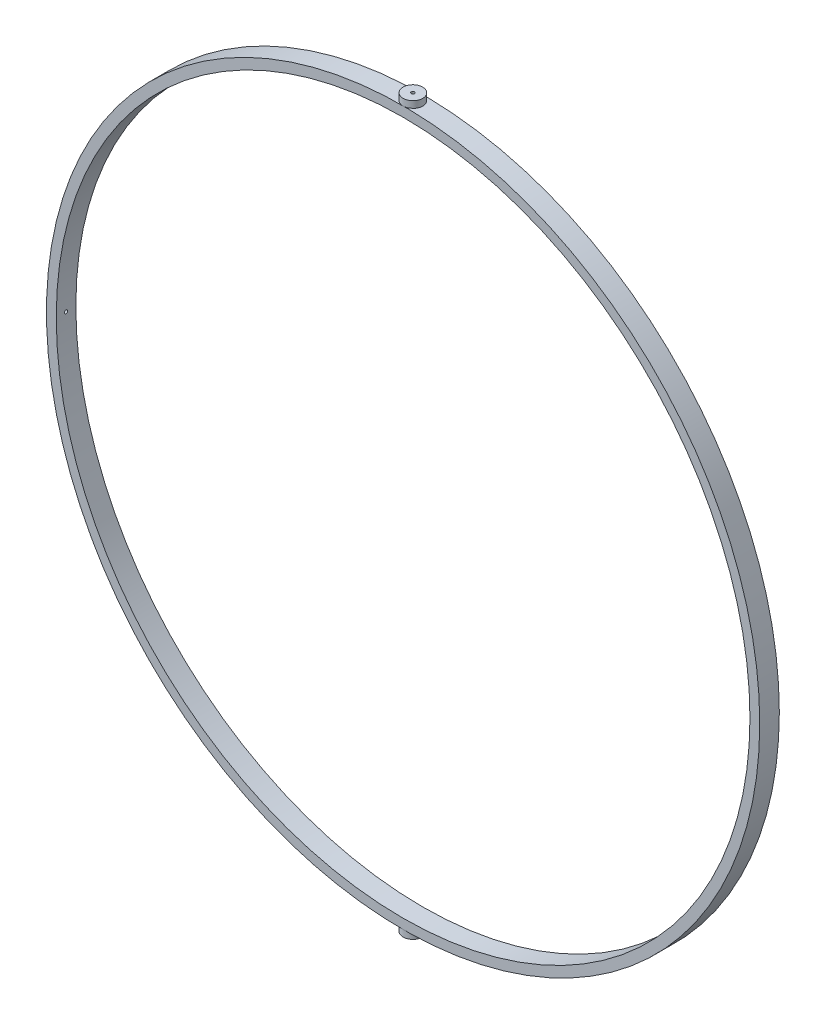
ISO-10303-21;
HEADER;
FILE_DESCRIPTION(('STEP AP214'),'2;1');
FILE_NAME('part.step','',(''),(''),'','','');
FILE_SCHEMA(('AUTOMOTIVE_DESIGN { 1 0 10303 214 1 1 1 1 }'));
ENDSEC;
DATA;
#1=APPLICATION_CONTEXT('core data for automotive mechanical design processes');
#2=APPLICATION_PROTOCOL_DEFINITION('international standard','automotive_design',2000,#1);
#3=PRODUCT_CONTEXT('',#1,'mechanical');
#4=PRODUCT('Part','Part','',(#3));
#5=PRODUCT_RELATED_PRODUCT_CATEGORY('part','',(#4));
#6=PRODUCT_DEFINITION_FORMATION('','',#4);
#7=PRODUCT_DEFINITION_CONTEXT('part definition',#1,'design');
#8=PRODUCT_DEFINITION('design','',#6,#7);
#9=PRODUCT_DEFINITION_SHAPE('','',#8);
#10=(LENGTH_UNIT() NAMED_UNIT(*) SI_UNIT(.MILLI.,.METRE.));
#11=(NAMED_UNIT(*) PLANE_ANGLE_UNIT() SI_UNIT($,.RADIAN.));
#12=(NAMED_UNIT(*) SI_UNIT($,.STERADIAN.) SOLID_ANGLE_UNIT());
#13=UNCERTAINTY_MEASURE_WITH_UNIT(LENGTH_MEASURE(1.E-05),#10,'distance_accuracy_value','');
#14=(GEOMETRIC_REPRESENTATION_CONTEXT(3) GLOBAL_UNCERTAINTY_ASSIGNED_CONTEXT((#13)) GLOBAL_UNIT_ASSIGNED_CONTEXT((#10,
#11,#12)) REPRESENTATION_CONTEXT('',''));
#15=CARTESIAN_POINT('',(0.,0.,0.));
#16=DIRECTION('',(0.,0.,1.));
#17=DIRECTION('',(1.,0.,0.));
#18=AXIS2_PLACEMENT_3D('',#15,#16,#17);
#19=CARTESIAN_POINT('',(0.,111.24716621,3.));
#20=DIRECTION('',(0.,1.,0.));
#21=DIRECTION('',(0.,0.,1.));
#22=AXIS2_PLACEMENT_3D('',#19,#20,#21);
#23=PLANE('',#22);
#24=CARTESIAN_POINT('',(0.,111.24716621,3.));
#25=DIRECTION('',(0.,1.,0.));
#26=DIRECTION('',(0.,0.,1.));
#27=AXIS2_PLACEMENT_3D('',#24,#25,#26);
#28=CIRCLE('',#27,3.);
#29=CARTESIAN_POINT('',(0.,111.24716621,6.));
#30=VERTEX_POINT('',#29);
#31=EDGE_CURVE('E11',#30,#30,#28,.T.);
#32=ORIENTED_EDGE('',*,*,#31,.T.);
#33=EDGE_LOOP('',(#32));
#34=FACE_BOUND('',#33,.T.);
#35=CARTESIAN_POINT('',(0.,111.24716621,3.));
#36=DIRECTION('',(0.,1.,0.));
#37=DIRECTION('',(0.,0.,1.));
#38=AXIS2_PLACEMENT_3D('',#35,#36,#37);
#39=CIRCLE('',#38,0.5);
#40=CARTESIAN_POINT('',(0.,111.24716621,3.5));
#41=VERTEX_POINT('',#40);
#42=EDGE_CURVE('E54',#41,#41,#39,.T.);
#43=ORIENTED_EDGE('',*,*,#42,.F.);
#44=EDGE_LOOP('',(#43));
#45=FACE_BOUND('',#44,.T.);
#46=ADVANCED_FACE('F43',(#34,#45),#23,.T.);
#47=CARTESIAN_POINT('',(0.,106.24716621,3.));
#48=DIRECTION('',(0.,1.,0.));
#49=DIRECTION('',(0.,0.,1.));
#50=AXIS2_PLACEMENT_3D('',#47,#48,#49);
#51=PLANE('',#50);
#52=CARTESIAN_POINT('',(0.,106.24716621,3.));
#53=DIRECTION('',(0.,1.,0.));
#54=DIRECTION('',(0.,0.,1.));
#55=AXIS2_PLACEMENT_3D('',#52,#53,#54);
#56=CIRCLE('',#55,3.);
#57=CARTESIAN_POINT('',(0.,106.24716621,6.));
#58=VERTEX_POINT('',#57);
#59=EDGE_CURVE('E47',#58,#58,#56,.T.);
#60=ORIENTED_EDGE('',*,*,#59,.F.);
#61=EDGE_LOOP('',(#60));
#62=FACE_BOUND('',#61,.T.);
#63=CARTESIAN_POINT('',(0.,106.24716621,3.));
#64=DIRECTION('',(0.,1.,0.));
#65=DIRECTION('',(0.,0.,1.));
#66=AXIS2_PLACEMENT_3D('',#63,#64,#65);
#67=CIRCLE('',#66,0.5);
#68=CARTESIAN_POINT('',(0.,106.24716621,3.5));
#69=VERTEX_POINT('',#68);
#70=EDGE_CURVE('E56',#69,#69,#67,.T.);
#71=ORIENTED_EDGE('',*,*,#70,.T.);
#72=EDGE_LOOP('',(#71));
#73=FACE_BOUND('',#72,.T.);
#74=ADVANCED_FACE('F66',(#62,#73),#51,.F.);
#75=CARTESIAN_POINT('',(0.,111.24716621,3.));
#76=DIRECTION('',(0.,-1.,0.));
#77=DIRECTION('',(0.,0.,-1.));
#78=AXIS2_PLACEMENT_3D('',#75,#76,#77);
#79=CYLINDRICAL_SURFACE('',#78,3.);
#80=ORIENTED_EDGE('',*,*,#31,.F.);
#81=EDGE_LOOP('',(#80));
#82=FACE_BOUND('',#81,.T.);
#83=ORIENTED_EDGE('',*,*,#59,.T.);
#84=EDGE_LOOP('',(#83));
#85=FACE_BOUND('',#84,.T.);
#86=ADVANCED_FACE('F45',(#82,#85),#79,.T.);
#87=CARTESIAN_POINT('',(0.,111.24716621,3.));
#88=DIRECTION('',(0.,-1.,0.));
#89=DIRECTION('',(0.,0.,-1.));
#90=AXIS2_PLACEMENT_3D('',#87,#88,#89);
#91=CYLINDRICAL_SURFACE('',#90,0.5);
#92=ORIENTED_EDGE('',*,*,#42,.T.);
#93=EDGE_LOOP('',(#92));
#94=FACE_BOUND('',#93,.T.);
#95=ORIENTED_EDGE('',*,*,#70,.F.);
#96=EDGE_LOOP('',(#95));
#97=FACE_BOUND('',#96,.T.);
#98=ADVANCED_FACE('F62',(#94,#97),#91,.F.);
#99=CLOSED_SHELL('',(#46,#74,#86,#98));
#100=MANIFOLD_SOLID_BREP('B2',#99);
#101=CARTESIAN_POINT('',(0.,-111.24716621,3.00000000000001));
#102=DIRECTION('',(0.,1.,0.));
#103=DIRECTION('',(0.,0.,1.));
#104=AXIS2_PLACEMENT_3D('',#101,#102,#103);
#105=CYLINDRICAL_SURFACE('',#104,3.);
#106=CARTESIAN_POINT('',(0.,-111.24716621,3.00000000000001));
#107=DIRECTION('',(0.,1.,0.));
#108=DIRECTION('',(0.,0.,1.));
#109=AXIS2_PLACEMENT_3D('',#106,#107,#108);
#110=CIRCLE('',#109,3.);
#111=CARTESIAN_POINT('',(0.,-111.24716621,6.00000000000001));
#112=VERTEX_POINT('',#111);
#113=EDGE_CURVE('E42',#112,#112,#110,.T.);
#114=ORIENTED_EDGE('',*,*,#113,.T.);
#115=EDGE_LOOP('',(#114));
#116=FACE_BOUND('',#115,.T.);
#117=CARTESIAN_POINT('',(0.,-106.24716621,3.00000000000001));
#118=DIRECTION('',(0.,1.,0.));
#119=DIRECTION('',(0.,0.,1.));
#120=AXIS2_PLACEMENT_3D('',#117,#118,#119);
#121=CIRCLE('',#120,3.);
#122=CARTESIAN_POINT('',(0.,-106.24716621,6.00000000000001));
#123=VERTEX_POINT('',#122);
#124=EDGE_CURVE('E114',#123,#123,#121,.T.);
#125=ORIENTED_EDGE('',*,*,#124,.F.);
#126=EDGE_LOOP('',(#125));
#127=FACE_BOUND('',#126,.T.);
#128=ADVANCED_FACE('F111',(#116,#127),#105,.T.);
#129=CARTESIAN_POINT('',(0.,-111.24716621,3.00000000000001));
#130=DIRECTION('',(0.,1.,0.));
#131=DIRECTION('',(0.,0.,1.));
#132=AXIS2_PLACEMENT_3D('',#129,#130,#131);
#133=PLANE('',#132);
#134=CARTESIAN_POINT('',(0.,-111.24716621,3.00000000000001));
#135=DIRECTION('',(0.,1.,0.));
#136=DIRECTION('',(0.,0.,1.));
#137=AXIS2_PLACEMENT_3D('',#134,#135,#136);
#138=CIRCLE('',#137,0.5);
#139=CARTESIAN_POINT('',(0.,-111.24716621,3.50000000000001));
#140=VERTEX_POINT('',#139);
#141=EDGE_CURVE('E121',#140,#140,#138,.T.);
#142=ORIENTED_EDGE('',*,*,#141,.T.);
#143=EDGE_LOOP('',(#142));
#144=FACE_BOUND('',#143,.T.);
#145=ORIENTED_EDGE('',*,*,#113,.F.);
#146=EDGE_LOOP('',(#145));
#147=FACE_BOUND('',#146,.T.);
#148=ADVANCED_FACE('F129',(#144,#147),#133,.F.);
#149=CARTESIAN_POINT('',(0.,-106.24716621,3.00000000000001));
#150=DIRECTION('',(0.,1.,0.));
#151=DIRECTION('',(0.,0.,1.));
#152=AXIS2_PLACEMENT_3D('',#149,#150,#151);
#153=PLANE('',#152);
#154=CARTESIAN_POINT('',(0.,-106.24716621,3.00000000000001));
#155=DIRECTION('',(0.,1.,0.));
#156=DIRECTION('',(0.,0.,1.));
#157=AXIS2_PLACEMENT_3D('',#154,#155,#156);
#158=CIRCLE('',#157,0.5);
#159=CARTESIAN_POINT('',(0.,-106.24716621,3.50000000000001));
#160=VERTEX_POINT('',#159);
#161=EDGE_CURVE('E123',#160,#160,#158,.T.);
#162=ORIENTED_EDGE('',*,*,#161,.F.);
#163=EDGE_LOOP('',(#162));
#164=FACE_BOUND('',#163,.T.);
#165=ORIENTED_EDGE('',*,*,#124,.T.);
#166=EDGE_LOOP('',(#165));
#167=FACE_BOUND('',#166,.T.);
#168=ADVANCED_FACE('F135',(#164,#167),#153,.T.);
#169=CARTESIAN_POINT('',(0.,-111.24716621,3.00000000000001));
#170=DIRECTION('',(0.,1.,0.));
#171=DIRECTION('',(0.,0.,1.));
#172=AXIS2_PLACEMENT_3D('',#169,#170,#171);
#173=CYLINDRICAL_SURFACE('',#172,0.5);
#174=ORIENTED_EDGE('',*,*,#141,.F.);
#175=EDGE_LOOP('',(#174));
#176=FACE_BOUND('',#175,.T.);
#177=ORIENTED_EDGE('',*,*,#161,.T.);
#178=EDGE_LOOP('',(#177));
#179=FACE_BOUND('',#178,.T.);
#180=ADVANCED_FACE('F132',(#176,#179),#173,.F.);
#181=CLOSED_SHELL('',(#128,#148,#168,#180));
#182=MANIFOLD_SOLID_BREP('B6',#181);
#183=CARTESIAN_POINT('',(0.,0.,6.));
#184=DIRECTION('',(0.,0.,-1.));
#185=DIRECTION('',(-1.,0.,0.));
#186=AXIS2_PLACEMENT_3D('',#183,#184,#185);
#187=CYLINDRICAL_SURFACE('',#186,106.24716621);
#188=CARTESIAN_POINT('',(-106.24716621,0.,3.5));
#189=CARTESIAN_POINT('',(-106.24716619409,-0.0280850526568237,3.49999875463392));
#190=CARTESIAN_POINT('',(-106.247154954555,-0.0561904656604527,3.49762574936218));
#191=CARTESIAN_POINT('',(-106.247111198308,-0.111627242477362,3.48819229674412));
#192=CARTESIAN_POINT('',(-106.247078655992,-0.138957633456587,3.48112620839675));
#193=CARTESIAN_POINT('',(-106.246995980659,-0.192033204923472,3.46250775953338));
#194=CARTESIAN_POINT('',(-106.246945856049,-0.21777913622338,3.45095754312816));
#195=CARTESIAN_POINT('',(-106.246833674865,-0.266959234393877,3.42370165452289));
#196=CARTESIAN_POINT('',(-106.246771621257,-0.29039397386278,3.40799701515049));
#197=CARTESIAN_POINT('',(-106.246642562286,-0.334297344162967,3.372874777901));
#198=CARTESIAN_POINT('',(-106.246575556371,-0.354765643806542,3.35345676600548));
#199=CARTESIAN_POINT('',(-106.246444149999,-0.392152484654138,3.31145925078089));
#200=CARTESIAN_POINT('',(-106.246379749645,-0.409070886406095,3.28887962331087));
#201=CARTESIAN_POINT('',(-106.246260819028,-0.438876502583367,3.24120077201254));
#202=CARTESIAN_POINT('',(-106.246206288627,-0.451763773398321,3.21610158343571));
#203=CARTESIAN_POINT('',(-106.246113244895,-0.473141565467952,3.16409588385815));
#204=CARTESIAN_POINT('',(-106.246074731531,-0.481632095779887,3.13718937658063));
#205=CARTESIAN_POINT('',(-106.246018064117,-0.493975380155324,3.08233295235052));
#206=CARTESIAN_POINT('',(-106.245999909952,-0.497828160209652,3.05438304124628));
#207=CARTESIAN_POINT('',(-106.245986007366,-0.500786648823005,2.99823314619326));
#208=CARTESIAN_POINT('',(-106.245990258903,-0.499892366191744,2.97003316270867));
#209=CARTESIAN_POINT('',(-106.246020688169,-0.493382163260322,2.9141838111527));
#210=CARTESIAN_POINT('',(-106.246046865731,-0.48776627861956,2.88653443892449));
#211=CARTESIAN_POINT('',(-106.246118195506,-0.471972337070134,2.83257093749928));
#212=CARTESIAN_POINT('',(-106.246163347739,-0.461794275216539,2.80625680974957));
#213=CARTESIAN_POINT('',(-106.246267536485,-0.437164864263754,2.75571069654151));
#214=CARTESIAN_POINT('',(-106.246326573049,-0.422713499335047,2.73147871879646));
#215=CARTESIAN_POINT('',(-106.246451874467,-0.389947732001803,2.68578487159618));
#216=CARTESIAN_POINT('',(-106.246518139319,-0.371633330905123,2.66432300120312));
#217=CARTESIAN_POINT('',(-106.246650427281,-0.331661164895708,2.62477837580178));
#218=CARTESIAN_POINT('',(-106.246716450389,-0.310003367113331,2.60669565401851));
#219=CARTESIAN_POINT('',(-106.246840810657,-0.263959321890282,2.57442289446867));
#220=CARTESIAN_POINT('',(-106.246899147815,-0.239573074091296,2.56023285721332));
#221=CARTESIAN_POINT('',(-106.24700155914,-0.188764367965494,2.53614828744321));
#222=CARTESIAN_POINT('',(-106.247045633304,-0.162341909264108,2.52625375571864));
#223=CARTESIAN_POINT('',(-106.247114549579,-0.108210845149136,2.51104109363585));
#224=CARTESIAN_POINT('',(-106.247139391691,-0.0805022398781877,2.50572296277009));
#225=CARTESIAN_POINT('',(-106.247167042952,-0.0245857318079601,2.49981410770113));
#226=CARTESIAN_POINT('',(-106.247169852312,0.00362216619796849,2.49922333813856));
#227=CARTESIAN_POINT('',(-106.247153121895,0.0597367723237679,2.50278585784098));
#228=CARTESIAN_POINT('',(-106.247133582117,0.0876434804389804,2.50693914717934));
#229=CARTESIAN_POINT('',(-106.2470743565,0.142363391624133,2.51987184815417));
#230=CARTESIAN_POINT('',(-106.247034670749,0.169176599501214,2.52865123945146));
#231=CARTESIAN_POINT('',(-106.246939627402,0.220948506650455,2.5505869012439));
#232=CARTESIAN_POINT('',(-106.246884269806,0.245907206066894,2.56374317139853));
#233=CARTESIAN_POINT('',(-106.246764123273,0.293261802416632,2.59405923878603));
#234=CARTESIAN_POINT('',(-106.246699334265,0.315657680104834,2.61121906608004));
#235=CARTESIAN_POINT('',(-106.246567629513,0.357250696024964,2.64905509461572));
#236=CARTESIAN_POINT('',(-106.246500713768,0.376447832793392,2.66973129746622));
#237=CARTESIAN_POINT('',(-106.24637229918,0.411098562319901,2.71401333700411));
#238=CARTESIAN_POINT('',(-106.246310800381,0.426552124672,2.73761919748435));
#239=CARTESIAN_POINT('',(-106.24620015396,0.453276802600816,2.78709030320605));
#240=CARTESIAN_POINT('',(-106.246151006325,0.464547922716439,2.81295554599553));
#241=CARTESIAN_POINT('',(-106.246070603492,0.482587730610547,2.86621107949851));
#242=CARTESIAN_POINT('',(-106.246039348213,0.48935643908239,2.89360136320221));
#243=CARTESIAN_POINT('',(-106.245998253605,0.498199356896419,2.94912960033905));
#244=CARTESIAN_POINT('',(-106.245988414314,0.500273558088429,2.97726755507015));
#245=CARTESIAN_POINT('',(-106.24599126113,0.49966855635258,3.03349198801219));
#246=CARTESIAN_POINT('',(-106.246003946978,0.496989408356531,3.06157846681427));
#247=CARTESIAN_POINT('',(-106.246050413344,0.486953858481562,3.11690303823312));
#248=CARTESIAN_POINT('',(-106.246084193904,0.479597447199967,3.14414112914427));
#249=CARTESIAN_POINT('',(-106.246169041993,0.460416038264928,3.19699615574931));
#250=CARTESIAN_POINT('',(-106.246220109842,0.448590957467226,3.222613061269));
#251=CARTESIAN_POINT('',(-106.246333772389,0.420808392737228,3.27149701742432));
#252=CARTESIAN_POINT('',(-106.246396366634,0.404851070749366,3.29476416009858));
#253=CARTESIAN_POINT('',(-106.246526020563,0.369258721402353,3.33828720408426));
#254=CARTESIAN_POINT('',(-106.246593079823,0.349624043445579,3.3585433911526));
#255=CARTESIAN_POINT('',(-106.246724126631,0.307226943123988,3.39547702065792));
#256=CARTESIAN_POINT('',(-106.246788113411,0.284463744645473,3.41215357243196));
#257=CARTESIAN_POINT('',(-106.246905811215,0.236451688313928,3.44145471726159));
#258=CARTESIAN_POINT('',(-106.246959517274,0.211201638444088,3.45407735469089));
#259=CARTESIAN_POINT('',(-106.247050493819,0.158960534008959,3.47488979719271));
#260=CARTESIAN_POINT('',(-106.247087783996,0.131971610021824,3.48308491573569));
#261=CARTESIAN_POINT('',(-106.247131704384,0.0873422678778225,3.49262581566448));
#262=CARTESIAN_POINT('',(-106.247144588239,0.0699918337712364,3.49538768292258));
#263=CARTESIAN_POINT('',(-106.247161846018,0.0350969173106342,3.4990751642447));
#264=CARTESIAN_POINT('',(-106.247166219943,0.0175524349579925,3.50000077832174));
#265=CARTESIAN_POINT('',(-106.24716621,0.,3.5));
#266=B_SPLINE_CURVE_WITH_KNOTS('',3,(#188,#189,#190,#191,#192,#193,#194,#195,#196,#197,#198,
#199,#200,#201,#202,#203,#204,#205,#206,#207,#208,#209,#210,#211,#212,#213,#214,#215,#216,#217,
#218,#219,#220,#221,#222,#223,#224,#225,#226,#227,#228,#229,#230,#231,#232,#233,#234,#235,#236,
#237,#238,#239,#240,#241,#242,#243,#244,#245,#246,#247,#248,#249,#250,#251,#252,#253,#254,#255,
#256,#257,#258,#259,#260,#261,#262,#263,#264,#265),.UNSPECIFIED.,.T.,.F.,(4,2,2,2,2,2,2,2,2,2,2,
2,2,2,2,2,2,2,2,2,2,2,2,2,2,2,2,2,2,2,2,2,2,2,2,2,2,2,4),(0.,0.0841910915724384,
0.168483562899297,0.252735778854399,0.336967068588698,0.421207755079796,0.505451750212303,
0.589694566841535,0.673937209930408,0.758179380905462,0.842421395541886,0.926662773955109,
1.01090424367754,1.09514602545798,1.17938777871784,1.26363036022896,1.34787295280326,
1.43211556087436,1.51635815960266,1.60059995001644,1.68484174173316,1.76908316307426,
1.8533245778614,1.93756662520435,2.02180871108992,2.10605148118187,2.19029415985086,
2.2745364513327,2.35877888906821,2.44302035326711,2.52726198681668,2.61150518784692,
2.6957450878469,2.77997698788628,2.86422982175989,2.94852323873759,3.03271526910187,
3.08533253449892,3.1379497995233),.UNSPECIFIED.);
#267=CARTESIAN_POINT('',(-106.24716621,0.,3.5));
#268=VERTEX_POINT('',#267);
#269=EDGE_CURVE('E176',#268,#268,#266,.T.);
#270=ORIENTED_EDGE('',*,*,#269,.F.);
#271=EDGE_LOOP('',(#270));
#272=FACE_BOUND('',#271,.T.);
#273=CARTESIAN_POINT('',(0.,0.,0.));
#274=DIRECTION('',(0.,0.,1.));
#275=DIRECTION('',(1.,0.,0.));
#276=AXIS2_PLACEMENT_3D('',#273,#274,#275);
#277=CIRCLE('',#276,106.24716621);
#278=CARTESIAN_POINT('',(106.24716621,0.,0.));
#279=VERTEX_POINT('',#278);
#280=EDGE_CURVE('E193',#279,#279,#277,.T.);
#281=ORIENTED_EDGE('',*,*,#280,.F.);
#282=EDGE_LOOP('',(#281));
#283=FACE_BOUND('',#282,.T.);
#284=CARTESIAN_POINT('',(0.,0.,6.));
#285=DIRECTION('',(0.,0.,1.));
#286=DIRECTION('',(1.,0.,0.));
#287=AXIS2_PLACEMENT_3D('',#284,#285,#286);
#288=CIRCLE('',#287,106.24716621);
#289=CARTESIAN_POINT('',(106.24716621,0.,6.));
#290=VERTEX_POINT('',#289);
#291=EDGE_CURVE('E190',#290,#290,#288,.T.);
#292=ORIENTED_EDGE('',*,*,#291,.T.);
#293=EDGE_LOOP('',(#292));
#294=FACE_BOUND('',#293,.T.);
#295=CARTESIAN_POINT('',(106.24716621,0.,2.5));
#296=CARTESIAN_POINT('',(106.24716619409,0.0280850526568237,2.50000124536608));
#297=CARTESIAN_POINT('',(106.247154954555,0.0561904656604527,2.50237425063782));
#298=CARTESIAN_POINT('',(106.247111198308,0.111627242477362,2.51180770325588));
#299=CARTESIAN_POINT('',(106.247078655992,0.138957633456587,2.51887379160325));
#300=CARTESIAN_POINT('',(106.246995980659,0.192033204923473,2.53749224046662));
#301=CARTESIAN_POINT('',(106.246945856049,0.21777913622338,2.54904245687184));
#302=CARTESIAN_POINT('',(106.246833674865,0.266959234393878,2.57629834547711));
#303=CARTESIAN_POINT('',(106.246771621257,0.29039397386278,2.59200298484951));
#304=CARTESIAN_POINT('',(106.246642562286,0.334297344162967,2.627125222099));
#305=CARTESIAN_POINT('',(106.246575556371,0.354765643806542,2.64654323399452));
#306=CARTESIAN_POINT('',(106.246444149999,0.392152484654138,2.68854074921911));
#307=CARTESIAN_POINT('',(106.246379749645,0.409070886406095,2.71112037668913));
#308=CARTESIAN_POINT('',(106.246260819028,0.438876502583367,2.75879922798746));
#309=CARTESIAN_POINT('',(106.246206288627,0.451763773398321,2.78389841656429));
#310=CARTESIAN_POINT('',(106.246113244895,0.473141565467952,2.83590411614185));
#311=CARTESIAN_POINT('',(106.246074731531,0.481632095779887,2.86281062341937));
#312=CARTESIAN_POINT('',(106.246018064117,0.493975380155324,2.91766704764948));
#313=CARTESIAN_POINT('',(106.245999909952,0.497828160209652,2.94561695875372));
#314=CARTESIAN_POINT('',(106.245986007366,0.500786648823005,3.00176685380674));
#315=CARTESIAN_POINT('',(106.245990258903,0.499892366191744,3.02996683729133));
#316=CARTESIAN_POINT('',(106.246020688169,0.493382163260322,3.0858161888473));
#317=CARTESIAN_POINT('',(106.246046865731,0.48776627861956,3.11346556107551));
#318=CARTESIAN_POINT('',(106.246118195506,0.471972337070134,3.16742906250072));
#319=CARTESIAN_POINT('',(106.246163347739,0.461794275216539,3.19374319025043));
#320=CARTESIAN_POINT('',(106.246267536485,0.437164864263754,3.24428930345849));
#321=CARTESIAN_POINT('',(106.246326573049,0.422713499335047,3.26852128120354));
#322=CARTESIAN_POINT('',(106.246451874467,0.389947732001803,3.31421512840382));
#323=CARTESIAN_POINT('',(106.246518139319,0.371633330905123,3.33567699879688));
#324=CARTESIAN_POINT('',(106.246650427281,0.331661164895708,3.37522162419822));
#325=CARTESIAN_POINT('',(106.246716450389,0.310003367113331,3.39330434598149));
#326=CARTESIAN_POINT('',(106.246840810657,0.263959321890282,3.42557710553133));
#327=CARTESIAN_POINT('',(106.246899147815,0.239573074091296,3.43976714278668));
#328=CARTESIAN_POINT('',(106.24700155914,0.188764367965494,3.46385171255679));
#329=CARTESIAN_POINT('',(106.247045633304,0.162341909264108,3.47374624428136));
#330=CARTESIAN_POINT('',(106.247114549579,0.108210845149136,3.48895890636415));
#331=CARTESIAN_POINT('',(106.247139391691,0.0805022398781877,3.49427703722991));
#332=CARTESIAN_POINT('',(106.247167042952,0.0245857318079601,3.50018589229887));
#333=CARTESIAN_POINT('',(106.247169852312,-0.00362216619796849,3.50077666186144));
#334=CARTESIAN_POINT('',(106.247153121895,-0.0597367723237679,3.49721414215902));
#335=CARTESIAN_POINT('',(106.247133582117,-0.0876434804389804,3.49306085282066));
#336=CARTESIAN_POINT('',(106.2470743565,-0.142363391624133,3.48012815184583));
#337=CARTESIAN_POINT('',(106.247034670749,-0.169176599501214,3.47134876054854));
#338=CARTESIAN_POINT('',(106.246939627402,-0.220948506650455,3.4494130987561));
#339=CARTESIAN_POINT('',(106.246884269806,-0.245907206066894,3.43625682860147));
#340=CARTESIAN_POINT('',(106.246764123273,-0.293261802416632,3.40594076121397));
#341=CARTESIAN_POINT('',(106.246699334265,-0.315657680104834,3.38878093391996));
#342=CARTESIAN_POINT('',(106.246567629513,-0.357250696024964,3.35094490538428));
#343=CARTESIAN_POINT('',(106.246500713768,-0.376447832793392,3.33026870253378));
#344=CARTESIAN_POINT('',(106.24637229918,-0.411098562319902,3.28598666299589));
#345=CARTESIAN_POINT('',(106.246310800381,-0.426552124672001,3.26238080251565));
#346=CARTESIAN_POINT('',(106.24620015396,-0.453276802600816,3.21290969679395));
#347=CARTESIAN_POINT('',(106.246151006325,-0.464547922716439,3.18704445400447));
#348=CARTESIAN_POINT('',(106.246070603492,-0.482587730610547,3.13378892050149));
#349=CARTESIAN_POINT('',(106.246039348213,-0.48935643908239,3.10639863679779));
#350=CARTESIAN_POINT('',(106.245998253605,-0.498199356896419,3.05087039966095));
#351=CARTESIAN_POINT('',(106.245988414314,-0.500273558088429,3.02273244492985));
#352=CARTESIAN_POINT('',(106.24599126113,-0.49966855635258,2.96650801198781));
#353=CARTESIAN_POINT('',(106.246003946978,-0.496989408356531,2.93842153318573));
#354=CARTESIAN_POINT('',(106.246050413344,-0.486953858481562,2.88309696176688));
#355=CARTESIAN_POINT('',(106.246084193904,-0.479597447199967,2.85585887085573));
#356=CARTESIAN_POINT('',(106.246169041993,-0.460416038264928,2.80300384425069));
#357=CARTESIAN_POINT('',(106.246220109842,-0.448590957467226,2.777386938731));
#358=CARTESIAN_POINT('',(106.246333772389,-0.420808392737228,2.72850298257568));
#359=CARTESIAN_POINT('',(106.246396366634,-0.404851070749366,2.70523583990142));
#360=CARTESIAN_POINT('',(106.246526020563,-0.369258721402353,2.66171279591574));
#361=CARTESIAN_POINT('',(106.246593079823,-0.349624043445579,2.6414566088474));
#362=CARTESIAN_POINT('',(106.246724126631,-0.307226943123988,2.60452297934208));
#363=CARTESIAN_POINT('',(106.246788113411,-0.284463744645473,2.58784642756804));
#364=CARTESIAN_POINT('',(106.246905811215,-0.236451688313928,2.55854528273841));
#365=CARTESIAN_POINT('',(106.246959517274,-0.211201638444088,2.54592264530911));
#366=CARTESIAN_POINT('',(106.247050493819,-0.158960534008959,2.52511020280729));
#367=CARTESIAN_POINT('',(106.247087783996,-0.131971610021824,2.51691508426431));
#368=CARTESIAN_POINT('',(106.247131704384,-0.0873422678778225,2.50737418433552));
#369=CARTESIAN_POINT('',(106.247144588239,-0.0699918337712364,2.50461231707743));
#370=CARTESIAN_POINT('',(106.247161846018,-0.0350969173106342,2.5009248357553));
#371=CARTESIAN_POINT('',(106.247166219943,-0.0175524349579925,2.49999922167826));
#372=CARTESIAN_POINT('',(106.24716621,0.,2.5));
#373=B_SPLINE_CURVE_WITH_KNOTS('',3,(#295,#296,#297,#298,#299,#300,#301,#302,#303,#304,#305,
#306,#307,#308,#309,#310,#311,#312,#313,#314,#315,#316,#317,#318,#319,#320,#321,#322,#323,#324,
#325,#326,#327,#328,#329,#330,#331,#332,#333,#334,#335,#336,#337,#338,#339,#340,#341,#342,#343,
#344,#345,#346,#347,#348,#349,#350,#351,#352,#353,#354,#355,#356,#357,#358,#359,#360,#361,#362,
#363,#364,#365,#366,#367,#368,#369,#370,#371,#372),.UNSPECIFIED.,.T.,.F.,(4,2,2,2,2,2,2,2,2,2,2,
2,2,2,2,2,2,2,2,2,2,2,2,2,2,2,2,2,2,2,2,2,2,2,2,2,2,2,4),(0.,0.0841910915724384,
0.168483562899297,0.252735778854399,0.336967068588698,0.421207755079796,0.505451750212303,
0.589694566841535,0.673937209930408,0.758179380905462,0.842421395541886,0.926662773955109,
1.01090424367754,1.09514602545798,1.17938777871784,1.26363036022896,1.34787295280326,
1.43211556087436,1.51635815960266,1.60059995001644,1.68484174173316,1.76908316307426,
1.8533245778614,1.93756662520435,2.02180871108992,2.10605148118187,2.19029415985086,
2.2745364513327,2.35877888906821,2.44302035326711,2.52726198681668,2.61150518784692,
2.6957450878469,2.77997698788628,2.86422982175989,2.94852323873759,3.03271526910186,
3.08533253449892,3.1379497995233),.UNSPECIFIED.);
#374=CARTESIAN_POINT('',(106.24716621,0.,2.5));
#375=VERTEX_POINT('',#374);
#376=EDGE_CURVE('E195',#375,#375,#373,.T.);
#377=ORIENTED_EDGE('',*,*,#376,.T.);
#378=EDGE_LOOP('',(#377));
#379=FACE_BOUND('',#378,.T.);
#380=ADVANCED_FACE('F172',(#272,#283,#294,#379),#187,.F.);
#381=CARTESIAN_POINT('',(0.,0.,6.));
#382=DIRECTION('',(0.,0.,1.));
#383=DIRECTION('',(1.,0.,0.));
#384=AXIS2_PLACEMENT_3D('',#381,#382,#383);
#385=PLANE('',#384);
#386=CARTESIAN_POINT('',(0.,0.,6.));
#387=DIRECTION('',(0.,0.,1.));
#388=DIRECTION('',(1.,0.,0.));
#389=AXIS2_PLACEMENT_3D('',#386,#387,#388);
#390=CIRCLE('',#389,109.24716621);
#391=CARTESIAN_POINT('',(109.24716621,0.,6.));
#392=VERTEX_POINT('',#391);
#393=EDGE_CURVE('E110',#392,#392,#390,.T.);
#394=ORIENTED_EDGE('',*,*,#393,.T.);
#395=EDGE_LOOP('',(#394));
#396=FACE_BOUND('',#395,.T.);
#397=ORIENTED_EDGE('',*,*,#291,.F.);
#398=EDGE_LOOP('',(#397));
#399=FACE_BOUND('',#398,.T.);
#400=ADVANCED_FACE('F224',(#396,#399),#385,.T.);
#401=CARTESIAN_POINT('',(0.,0.,0.));
#402=DIRECTION('',(0.,0.,1.));
#403=DIRECTION('',(1.,0.,0.));
#404=AXIS2_PLACEMENT_3D('',#401,#402,#403);
#405=PLANE('',#404);
#406=CARTESIAN_POINT('',(0.,0.,0.));
#407=DIRECTION('',(0.,0.,1.));
#408=DIRECTION('',(1.,0.,0.));
#409=AXIS2_PLACEMENT_3D('',#406,#407,#408);
#410=CIRCLE('',#409,109.24716621);
#411=CARTESIAN_POINT('',(109.24716621,0.,0.));
#412=VERTEX_POINT('',#411);
#413=EDGE_CURVE('E185',#412,#412,#410,.T.);
#414=ORIENTED_EDGE('',*,*,#413,.F.);
#415=EDGE_LOOP('',(#414));
#416=FACE_BOUND('',#415,.T.);
#417=ORIENTED_EDGE('',*,*,#280,.T.);
#418=EDGE_LOOP('',(#417));
#419=FACE_BOUND('',#418,.T.);
#420=ADVANCED_FACE('F229',(#416,#419),#405,.F.);
#421=CARTESIAN_POINT('',(0.,0.,6.));
#422=DIRECTION('',(0.,0.,-1.));
#423=DIRECTION('',(-1.,0.,0.));
#424=AXIS2_PLACEMENT_3D('',#421,#422,#423);
#425=CYLINDRICAL_SURFACE('',#424,109.24716621);
#426=ORIENTED_EDGE('',*,*,#393,.F.);
#427=EDGE_LOOP('',(#426));
#428=FACE_BOUND('',#427,.T.);
#429=ORIENTED_EDGE('',*,*,#413,.T.);
#430=EDGE_LOOP('',(#429));
#431=FACE_BOUND('',#430,.T.);
#432=ADVANCED_FACE('F174',(#428,#431),#425,.T.);
#433=CARTESIAN_POINT('',(105.24716621,0.,3.));
#434=DIRECTION('',(1.,0.,0.));
#435=DIRECTION('',(0.,0.,-1.));
#436=AXIS2_PLACEMENT_3D('',#433,#434,#435);
#437=CYLINDRICAL_SURFACE('',#436,0.5);
#438=ORIENTED_EDGE('',*,*,#376,.F.);
#439=EDGE_LOOP('',(#438));
#440=FACE_BOUND('',#439,.T.);
#441=CARTESIAN_POINT('',(108.24716621,0.,3.));
#442=DIRECTION('',(-1.,0.,0.));
#443=DIRECTION('',(0.,0.,1.));
#444=AXIS2_PLACEMENT_3D('',#441,#442,#443);
#445=CIRCLE('',#444,0.5);
#446=CARTESIAN_POINT('',(108.24716621,0.,3.5));
#447=VERTEX_POINT('',#446);
#448=EDGE_CURVE('E201',#447,#447,#445,.T.);
#449=ORIENTED_EDGE('',*,*,#448,.F.);
#450=EDGE_LOOP('',(#449));
#451=FACE_BOUND('',#450,.T.);
#452=ADVANCED_FACE('F204',(#440,#451),#437,.F.);
#453=CARTESIAN_POINT('',(108.24716621,0.,3.));
#454=DIRECTION('',(-1.,0.,0.));
#455=DIRECTION('',(0.,0.,1.));
#456=AXIS2_PLACEMENT_3D('',#453,#454,#455);
#457=PLANE('',#456);
#458=ORIENTED_EDGE('',*,*,#448,.T.);
#459=EDGE_LOOP('',(#458));
#460=FACE_BOUND('',#459,.T.);
#461=ADVANCED_FACE('F208',(#460),#457,.T.);
#462=CARTESIAN_POINT('',(-105.24716621,0.,3.));
#463=DIRECTION('',(-1.,0.,0.));
#464=DIRECTION('',(0.,0.,1.));
#465=AXIS2_PLACEMENT_3D('',#462,#463,#464);
#466=CYLINDRICAL_SURFACE('',#465,0.5);
#467=ORIENTED_EDGE('',*,*,#269,.T.);
#468=EDGE_LOOP('',(#467));
#469=FACE_BOUND('',#468,.T.);
#470=CARTESIAN_POINT('',(-108.24716621,0.,3.));
#471=DIRECTION('',(-1.,0.,0.));
#472=DIRECTION('',(0.,0.,1.));
#473=AXIS2_PLACEMENT_3D('',#470,#471,#472);
#474=CIRCLE('',#473,0.5);
#475=CARTESIAN_POINT('',(-108.24716621,0.,3.5));
#476=VERTEX_POINT('',#475);
#477=EDGE_CURVE('E244',#476,#476,#474,.T.);
#478=ORIENTED_EDGE('',*,*,#477,.T.);
#479=EDGE_LOOP('',(#478));
#480=FACE_BOUND('',#479,.T.);
#481=ADVANCED_FACE('F211',(#469,#480),#466,.F.);
#482=CARTESIAN_POINT('',(-108.24716621,0.,3.));
#483=DIRECTION('',(-1.,0.,0.));
#484=DIRECTION('',(0.,0.,1.));
#485=AXIS2_PLACEMENT_3D('',#482,#483,#484);
#486=PLANE('',#485);
#487=ORIENTED_EDGE('',*,*,#477,.F.);
#488=EDGE_LOOP('',(#487));
#489=FACE_BOUND('',#488,.T.);
#490=ADVANCED_FACE('F216',(#489),#486,.F.);
#491=CLOSED_SHELL('',(#380,#400,#420,#432,#452,#461,#481,#490));
#492=MANIFOLD_SOLID_BREP('B37',#491);
#493=ADVANCED_BREP_SHAPE_REPRESENTATION('',(#18,#100,#182,#492),#14);
#494=SHAPE_DEFINITION_REPRESENTATION(#9,#493);
ENDSEC;
END-ISO-10303-21;
